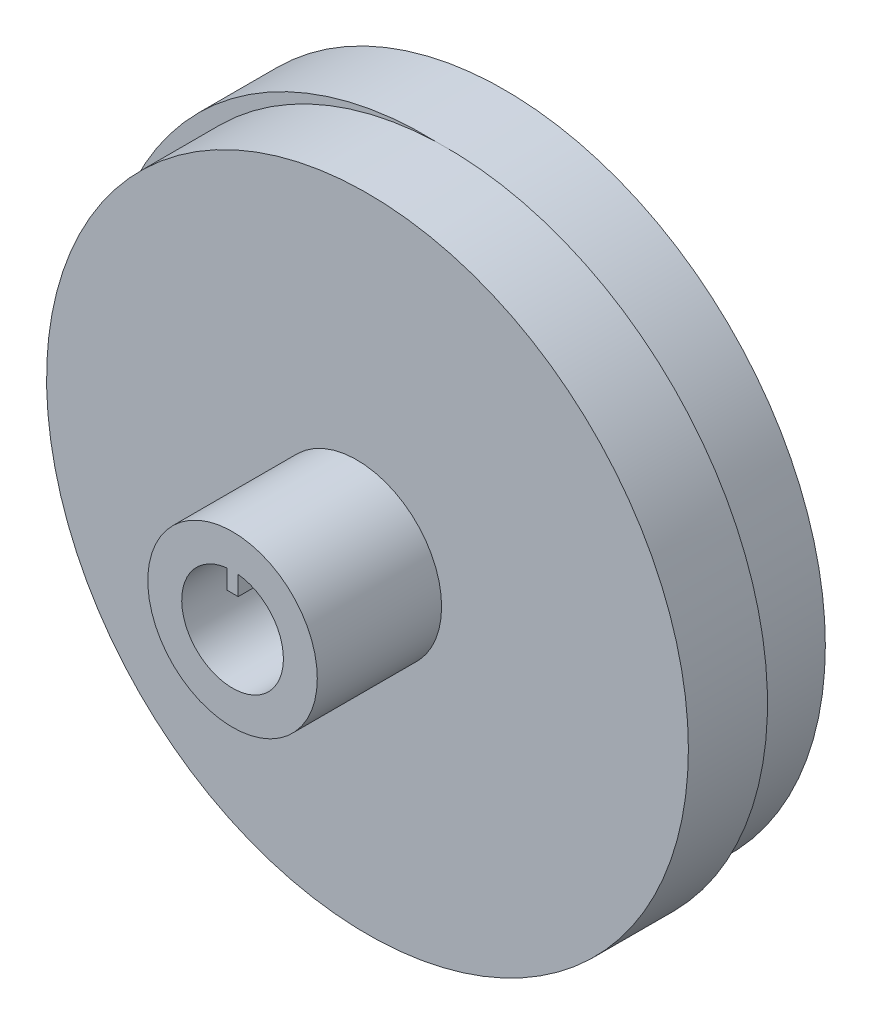
ISO-10303-21;
HEADER;
FILE_DESCRIPTION(('STEP AP214'),'2;1');
FILE_NAME('part.step','',(''),(''),'','','');
FILE_SCHEMA(('AUTOMOTIVE_DESIGN { 1 0 10303 214 1 1 1 1 }'));
ENDSEC;
DATA;
#1=APPLICATION_CONTEXT('core data for automotive mechanical design processes');
#2=APPLICATION_PROTOCOL_DEFINITION('international standard','automotive_design',2000,#1);
#3=PRODUCT_CONTEXT('',#1,'mechanical');
#4=PRODUCT('Part','Part','',(#3));
#5=PRODUCT_RELATED_PRODUCT_CATEGORY('part','',(#4));
#6=PRODUCT_DEFINITION_FORMATION('','',#4);
#7=PRODUCT_DEFINITION_CONTEXT('part definition',#1,'design');
#8=PRODUCT_DEFINITION('design','',#6,#7);
#9=PRODUCT_DEFINITION_SHAPE('','',#8);
#10=(LENGTH_UNIT() NAMED_UNIT(*) SI_UNIT(.MILLI.,.METRE.));
#11=(NAMED_UNIT(*) PLANE_ANGLE_UNIT() SI_UNIT($,.RADIAN.));
#12=(NAMED_UNIT(*) SI_UNIT($,.STERADIAN.) SOLID_ANGLE_UNIT());
#13=UNCERTAINTY_MEASURE_WITH_UNIT(LENGTH_MEASURE(1.E-05),#10,'distance_accuracy_value','');
#14=(GEOMETRIC_REPRESENTATION_CONTEXT(3) GLOBAL_UNCERTAINTY_ASSIGNED_CONTEXT((#13)) GLOBAL_UNIT_ASSIGNED_CONTEXT((#10,
#11,#12)) REPRESENTATION_CONTEXT('',''));
#15=CARTESIAN_POINT('',(0.,0.,0.));
#16=DIRECTION('',(0.,0.,1.));
#17=DIRECTION('',(1.,0.,0.));
#18=AXIS2_PLACEMENT_3D('',#15,#16,#17);
#19=CARTESIAN_POINT('',(0.940000000000001,0.,25.));
#20=DIRECTION('',(0.,0.,1.));
#21=DIRECTION('',(1.,0.,0.));
#22=AXIS2_PLACEMENT_3D('',#19,#20,#21);
#23=PLANE('',#22);
#24=CARTESIAN_POINT('',(0.940000000000001,0.,25.));
#25=DIRECTION('',(0.,0.,1.));
#26=DIRECTION('',(1.,0.,0.));
#27=AXIS2_PLACEMENT_3D('',#24,#25,#26);
#28=CIRCLE('',#27,7.5);
#29=CARTESIAN_POINT('',(8.44,0.,25.));
#30=VERTEX_POINT('',#29);
#31=EDGE_CURVE('E103',#30,#30,#28,.T.);
#32=ORIENTED_EDGE('',*,*,#31,.T.);
#33=EDGE_LOOP('',(#32));
#34=FACE_BOUND('',#33,.T.);
#35=CARTESIAN_POINT('',(0.93999999999999,0.,25.));
#36=DIRECTION('',(0.,0.,1.));
#37=DIRECTION('',(1.,0.,0.));
#38=AXIS2_PLACEMENT_3D('',#35,#36,#37);
#39=CIRCLE('',#38,4.5);
#40=CARTESIAN_POINT('',(0.44,4.47213595499958,25.));
#41=VERTEX_POINT('',#40);
#42=CARTESIAN_POINT('',(1.44,4.47213595499958,25.));
#43=VERTEX_POINT('',#42);
#44=EDGE_CURVE('E98',#41,#43,#39,.T.);
#45=ORIENTED_EDGE('',*,*,#44,.F.);
#46=DIRECTION('',(0.,-1.,0.));
#47=VECTOR('',#46,1.);
#48=CARTESIAN_POINT('',(0.44,4.47213595499958,25.));
#49=LINE('',#48,#47);
#50=CARTESIAN_POINT('',(0.44,2.770056,25.));
#51=VERTEX_POINT('',#50);
#52=EDGE_CURVE('E51',#41,#51,#49,.T.);
#53=ORIENTED_EDGE('',*,*,#52,.T.);
#54=DIRECTION('',(1.,0.,0.));
#55=VECTOR('',#54,1.);
#56=CARTESIAN_POINT('',(0.44,2.770056,25.));
#57=LINE('',#56,#55);
#58=CARTESIAN_POINT('',(1.44,2.770056,25.));
#59=VERTEX_POINT('',#58);
#60=EDGE_CURVE('E102',#51,#59,#57,.T.);
#61=ORIENTED_EDGE('',*,*,#60,.T.);
#62=DIRECTION('',(0.,1.,0.));
#63=VECTOR('',#62,1.);
#64=CARTESIAN_POINT('',(1.44,2.770056,25.));
#65=LINE('',#64,#63);
#66=EDGE_CURVE('E251',#59,#43,#65,.T.);
#67=ORIENTED_EDGE('',*,*,#66,.T.);
#68=EDGE_LOOP('',(#45,#53,#61,#67));
#69=FACE_BOUND('',#68,.T.);
#70=ADVANCED_FACE('F34',(#34,#69),#23,.T.);
#71=CARTESIAN_POINT('',(0.,0.,7.));
#72=DIRECTION('',(0.,0.,-1.));
#73=DIRECTION('',(-1.,0.,0.));
#74=AXIS2_PLACEMENT_3D('',#71,#72,#73);
#75=CYLINDRICAL_SURFACE('',#74,28.4);
#76=CARTESIAN_POINT('',(0.,0.,7.));
#77=DIRECTION('',(0.,0.,1.));
#78=DIRECTION('',(1.,0.,0.));
#79=AXIS2_PLACEMENT_3D('',#76,#77,#78);
#80=CIRCLE('',#79,28.4);
#81=CARTESIAN_POINT('',(0.94000000000021,28.3844393990792,7.));
#82=VERTEX_POINT('',#81);
#83=CARTESIAN_POINT('',(0.94000000000021,-28.3844393990792,7.));
#84=VERTEX_POINT('',#83);
#85=EDGE_CURVE('E43',#82,#84,#80,.T.);
#86=ORIENTED_EDGE('',*,*,#85,.F.);
#87=EDGE_CURVE('E116',#84,#82,#80,.T.);
#88=ORIENTED_EDGE('',*,*,#87,.F.);
#89=EDGE_LOOP('',(#86,#88));
#90=FACE_BOUND('',#89,.T.);
#91=CARTESIAN_POINT('',(0.,0.,0.));
#92=DIRECTION('',(0.,0.,1.));
#93=DIRECTION('',(1.,0.,0.));
#94=AXIS2_PLACEMENT_3D('',#91,#92,#93);
#95=CIRCLE('',#94,28.4);
#96=CARTESIAN_POINT('',(28.4,0.,0.));
#97=VERTEX_POINT('',#96);
#98=EDGE_CURVE('E38',#97,#97,#95,.T.);
#99=ORIENTED_EDGE('',*,*,#98,.T.);
#100=EDGE_LOOP('',(#99));
#101=FACE_BOUND('',#100,.T.);
#102=ADVANCED_FACE('F36',(#90,#101),#75,.T.);
#103=CARTESIAN_POINT('',(0.,0.,7.));
#104=DIRECTION('',(0.,0.,1.));
#105=DIRECTION('',(1.,0.,0.));
#106=AXIS2_PLACEMENT_3D('',#103,#104,#105);
#107=PLANE('',#106);
#108=CARTESIAN_POINT('',(1.88,0.,7.));
#109=DIRECTION('',(0.,0.,1.));
#110=DIRECTION('',(1.,0.,0.));
#111=AXIS2_PLACEMENT_3D('',#108,#109,#110);
#112=CIRCLE('',#111,28.4);
#113=EDGE_CURVE('E58',#82,#84,#112,.T.);
#114=ORIENTED_EDGE('',*,*,#113,.F.);
#115=ORIENTED_EDGE('',*,*,#85,.T.);
#116=EDGE_LOOP('',(#114,#115));
#117=FACE_BOUND('',#116,.T.);
#118=ADVANCED_FACE('F129',(#117),#107,.T.);
#119=CARTESIAN_POINT('',(0.,0.,0.));
#120=DIRECTION('',(0.,0.,1.));
#121=DIRECTION('',(1.,0.,0.));
#122=AXIS2_PLACEMENT_3D('',#119,#120,#121);
#123=PLANE('',#122);
#124=ORIENTED_EDGE('',*,*,#98,.F.);
#125=EDGE_LOOP('',(#124));
#126=FACE_BOUND('',#125,.T.);
#127=ADVANCED_FACE('F126',(#126),#123,.F.);
#128=CARTESIAN_POINT('',(1.88,0.,7.));
#129=DIRECTION('',(0.,0.,1.));
#130=DIRECTION('',(1.,0.,0.));
#131=AXIS2_PLACEMENT_3D('',#128,#129,#130);
#132=PLANE('',#131);
#133=EDGE_CURVE('E107',#84,#82,#112,.T.);
#134=ORIENTED_EDGE('',*,*,#133,.F.);
#135=ORIENTED_EDGE('',*,*,#87,.T.);
#136=EDGE_LOOP('',(#134,#135));
#137=FACE_BOUND('',#136,.T.);
#138=ADVANCED_FACE('F128',(#137),#132,.F.);
#139=CARTESIAN_POINT('',(1.88,0.,14.));
#140=DIRECTION('',(0.,0.,-1.));
#141=DIRECTION('',(-1.,0.,0.));
#142=AXIS2_PLACEMENT_3D('',#139,#140,#141);
#143=CYLINDRICAL_SURFACE('',#142,28.4);
#144=CARTESIAN_POINT('',(1.88,0.,14.));
#145=DIRECTION('',(0.,0.,1.));
#146=DIRECTION('',(1.,0.,0.));
#147=AXIS2_PLACEMENT_3D('',#144,#145,#146);
#148=CIRCLE('',#147,28.4);
#149=CARTESIAN_POINT('',(30.28,0.,14.));
#150=VERTEX_POINT('',#149);
#151=EDGE_CURVE('E113',#150,#150,#148,.T.);
#152=ORIENTED_EDGE('',*,*,#151,.F.);
#153=EDGE_LOOP('',(#152));
#154=FACE_BOUND('',#153,.T.);
#155=ORIENTED_EDGE('',*,*,#113,.T.);
#156=ORIENTED_EDGE('',*,*,#133,.T.);
#157=EDGE_LOOP('',(#155,#156));
#158=FACE_BOUND('',#157,.T.);
#159=ADVANCED_FACE('F134',(#154,#158),#143,.T.);
#160=CARTESIAN_POINT('',(1.88,0.,14.));
#161=DIRECTION('',(0.,0.,1.));
#162=DIRECTION('',(1.,0.,0.));
#163=AXIS2_PLACEMENT_3D('',#160,#161,#162);
#164=PLANE('',#163);
#165=CARTESIAN_POINT('',(0.940000000000001,0.,14.));
#166=DIRECTION('',(0.,0.,1.));
#167=DIRECTION('',(1.,0.,0.));
#168=AXIS2_PLACEMENT_3D('',#165,#166,#167);
#169=CIRCLE('',#168,7.5);
#170=CARTESIAN_POINT('',(8.44,0.,14.));
#171=VERTEX_POINT('',#170);
#172=EDGE_CURVE('E11',#171,#171,#169,.T.);
#173=ORIENTED_EDGE('',*,*,#172,.F.);
#174=EDGE_LOOP('',(#173));
#175=FACE_BOUND('',#174,.T.);
#176=ORIENTED_EDGE('',*,*,#151,.T.);
#177=EDGE_LOOP('',(#176));
#178=FACE_BOUND('',#177,.T.);
#179=ADVANCED_FACE('F151',(#175,#178),#164,.T.);
#180=CARTESIAN_POINT('',(0.940000000000001,0.,25.));
#181=DIRECTION('',(0.,0.,-1.));
#182=DIRECTION('',(-1.,0.,0.));
#183=AXIS2_PLACEMENT_3D('',#180,#181,#182);
#184=CYLINDRICAL_SURFACE('',#183,7.5);
#185=ORIENTED_EDGE('',*,*,#31,.F.);
#186=EDGE_LOOP('',(#185));
#187=FACE_BOUND('',#186,.T.);
#188=ORIENTED_EDGE('',*,*,#172,.T.);
#189=EDGE_LOOP('',(#188));
#190=FACE_BOUND('',#189,.T.);
#191=ADVANCED_FACE('F148',(#187,#190),#184,.T.);
#192=CARTESIAN_POINT('',(0.44,4.47213595499958,15.));
#193=DIRECTION('',(-1.,0.,0.));
#194=DIRECTION('',(0.,-1.,0.));
#195=AXIS2_PLACEMENT_3D('',#192,#193,#194);
#196=PLANE('',#195);
#197=ORIENTED_EDGE('',*,*,#52,.F.);
#198=DIRECTION('',(0.,0.,1.));
#199=VECTOR('',#198,1.);
#200=CARTESIAN_POINT('',(0.44,4.47213595499958,15.));
#201=LINE('',#200,#199);
#202=CARTESIAN_POINT('',(0.44,4.47213595499958,15.));
#203=VERTEX_POINT('',#202);
#204=EDGE_CURVE('E97',#203,#41,#201,.T.);
#205=ORIENTED_EDGE('',*,*,#204,.F.);
#206=DIRECTION('',(0.,-1.,0.));
#207=VECTOR('',#206,1.);
#208=CARTESIAN_POINT('',(0.44,4.47213595499958,15.));
#209=LINE('',#208,#207);
#210=CARTESIAN_POINT('',(0.44,2.770056,15.));
#211=VERTEX_POINT('',#210);
#212=EDGE_CURVE('E88',#203,#211,#209,.T.);
#213=ORIENTED_EDGE('',*,*,#212,.T.);
#214=DIRECTION('',(0.,0.,1.));
#215=VECTOR('',#214,1.);
#216=CARTESIAN_POINT('',(0.44,2.770056,15.));
#217=LINE('',#216,#215);
#218=EDGE_CURVE('E96',#211,#51,#217,.T.);
#219=ORIENTED_EDGE('',*,*,#218,.T.);
#220=EDGE_LOOP('',(#197,#205,#213,#219));
#221=FACE_BOUND('',#220,.T.);
#222=ADVANCED_FACE('F95',(#221),#196,.T.);
#223=CARTESIAN_POINT('',(0.44,2.770056,15.));
#224=DIRECTION('',(0.,-1.,0.));
#225=DIRECTION('',(0.,0.,-1.));
#226=AXIS2_PLACEMENT_3D('',#223,#224,#225);
#227=PLANE('',#226);
#228=ORIENTED_EDGE('',*,*,#60,.F.);
#229=ORIENTED_EDGE('',*,*,#218,.F.);
#230=DIRECTION('',(1.,0.,0.));
#231=VECTOR('',#230,1.);
#232=CARTESIAN_POINT('',(0.44,2.770056,15.));
#233=LINE('',#232,#231);
#234=CARTESIAN_POINT('',(1.44,2.770056,15.));
#235=VERTEX_POINT('',#234);
#236=EDGE_CURVE('E84',#211,#235,#233,.T.);
#237=ORIENTED_EDGE('',*,*,#236,.T.);
#238=DIRECTION('',(0.,0.,1.));
#239=VECTOR('',#238,1.);
#240=CARTESIAN_POINT('',(1.44,2.770056,15.));
#241=LINE('',#240,#239);
#242=EDGE_CURVE('E104',#235,#59,#241,.T.);
#243=ORIENTED_EDGE('',*,*,#242,.T.);
#244=EDGE_LOOP('',(#228,#229,#237,#243));
#245=FACE_BOUND('',#244,.T.);
#246=ADVANCED_FACE('F100',(#245),#227,.T.);
#247=CARTESIAN_POINT('',(1.44,2.770056,15.));
#248=DIRECTION('',(1.,0.,0.));
#249=DIRECTION('',(0.,0.,-1.));
#250=AXIS2_PLACEMENT_3D('',#247,#248,#249);
#251=PLANE('',#250);
#252=ORIENTED_EDGE('',*,*,#66,.F.);
#253=ORIENTED_EDGE('',*,*,#242,.F.);
#254=DIRECTION('',(0.,1.,0.));
#255=VECTOR('',#254,1.);
#256=CARTESIAN_POINT('',(1.44,2.770056,15.));
#257=LINE('',#256,#255);
#258=CARTESIAN_POINT('',(1.44,4.47213595499958,15.));
#259=VERTEX_POINT('',#258);
#260=EDGE_CURVE('E90',#235,#259,#257,.T.);
#261=ORIENTED_EDGE('',*,*,#260,.T.);
#262=DIRECTION('',(0.,0.,1.));
#263=VECTOR('',#262,1.);
#264=CARTESIAN_POINT('',(1.44,4.47213595499958,15.));
#265=LINE('',#264,#263);
#266=EDGE_CURVE('E109',#259,#43,#265,.T.);
#267=ORIENTED_EDGE('',*,*,#266,.T.);
#268=EDGE_LOOP('',(#252,#253,#261,#267));
#269=FACE_BOUND('',#268,.T.);
#270=ADVANCED_FACE('F184',(#269),#251,.T.);
#271=CARTESIAN_POINT('',(0.93999999999999,0.,15.));
#272=DIRECTION('',(0.,0.,1.));
#273=DIRECTION('',(1.,0.,0.));
#274=AXIS2_PLACEMENT_3D('',#271,#272,#273);
#275=CYLINDRICAL_SURFACE('',#274,4.5);
#276=ORIENTED_EDGE('',*,*,#44,.T.);
#277=ORIENTED_EDGE('',*,*,#266,.F.);
#278=CARTESIAN_POINT('',(0.93999999999999,0.,15.));
#279=DIRECTION('',(0.,0.,1.));
#280=DIRECTION('',(1.,0.,0.));
#281=AXIS2_PLACEMENT_3D('',#278,#279,#280);
#282=CIRCLE('',#281,4.5);
#283=EDGE_CURVE('E258',#203,#259,#282,.T.);
#284=ORIENTED_EDGE('',*,*,#283,.F.);
#285=ORIENTED_EDGE('',*,*,#204,.T.);
#286=EDGE_LOOP('',(#276,#277,#284,#285));
#287=FACE_BOUND('',#286,.T.);
#288=ADVANCED_FACE('F190',(#287),#275,.F.);
#289=CARTESIAN_POINT('',(0.93999999999999,0.,15.));
#290=DIRECTION('',(0.,0.,1.));
#291=DIRECTION('',(1.,0.,0.));
#292=AXIS2_PLACEMENT_3D('',#289,#290,#291);
#293=PLANE('',#292);
#294=ORIENTED_EDGE('',*,*,#212,.F.);
#295=ORIENTED_EDGE('',*,*,#283,.T.);
#296=ORIENTED_EDGE('',*,*,#260,.F.);
#297=ORIENTED_EDGE('',*,*,#236,.F.);
#298=EDGE_LOOP('',(#294,#295,#296,#297));
#299=FACE_BOUND('',#298,.T.);
#300=ADVANCED_FACE('F86',(#299),#293,.T.);
#301=CLOSED_SHELL('',(#70,#102,#118,#127,#138,#159,#179,#191,#222,#246,#270,#288,#300));
#302=MANIFOLD_SOLID_BREP('B2',#301);
#303=ADVANCED_BREP_SHAPE_REPRESENTATION('',(#18,#302),#14);
#304=SHAPE_DEFINITION_REPRESENTATION(#9,#303);
ENDSEC;
END-ISO-10303-21;
